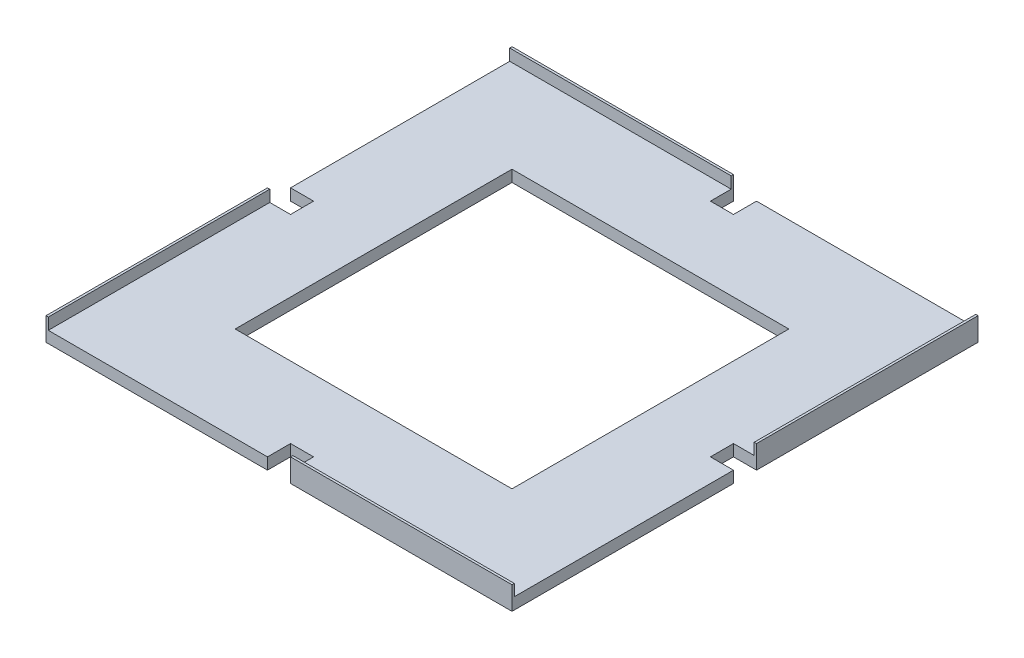
ISO-10303-21;
HEADER;
FILE_DESCRIPTION(('STEP AP214'),'2;1');
FILE_NAME('part.step','',(''),(''),'','','');
FILE_SCHEMA(('AUTOMOTIVE_DESIGN { 1 0 10303 214 1 1 1 1 }'));
ENDSEC;
DATA;
#1=APPLICATION_CONTEXT('core data for automotive mechanical design processes');
#2=APPLICATION_PROTOCOL_DEFINITION('international standard','automotive_design',2000,#1);
#3=PRODUCT_CONTEXT('',#1,'mechanical');
#4=PRODUCT('Part','Part','',(#3));
#5=PRODUCT_RELATED_PRODUCT_CATEGORY('part','',(#4));
#6=PRODUCT_DEFINITION_FORMATION('','',#4);
#7=PRODUCT_DEFINITION_CONTEXT('part definition',#1,'design');
#8=PRODUCT_DEFINITION('design','',#6,#7);
#9=PRODUCT_DEFINITION_SHAPE('','',#8);
#10=(LENGTH_UNIT() NAMED_UNIT(*) SI_UNIT(.MILLI.,.METRE.));
#11=(NAMED_UNIT(*) PLANE_ANGLE_UNIT() SI_UNIT($,.RADIAN.));
#12=(NAMED_UNIT(*) SI_UNIT($,.STERADIAN.) SOLID_ANGLE_UNIT());
#13=UNCERTAINTY_MEASURE_WITH_UNIT(LENGTH_MEASURE(1.E-05),#10,'distance_accuracy_value','');
#14=(GEOMETRIC_REPRESENTATION_CONTEXT(3) GLOBAL_UNCERTAINTY_ASSIGNED_CONTEXT((#13)) GLOBAL_UNIT_ASSIGNED_CONTEXT((#10,
#11,#12)) REPRESENTATION_CONTEXT('',''));
#15=CARTESIAN_POINT('',(0.,0.,0.));
#16=DIRECTION('',(0.,0.,1.));
#17=DIRECTION('',(1.,0.,0.));
#18=AXIS2_PLACEMENT_3D('',#15,#16,#17);
#19=CARTESIAN_POINT('',(0.,5.,0.));
#20=DIRECTION('',(0.,-1.,0.));
#21=DIRECTION('',(0.,0.,-1.));
#22=AXIS2_PLACEMENT_3D('',#19,#20,#21);
#23=PLANE('',#22);
#24=DIRECTION('',(0.,0.,-1.));
#25=VECTOR('',#24,1.);
#26=CARTESIAN_POINT('',(60.,5.,60.));
#27=LINE('',#26,#25);
#28=CARTESIAN_POINT('',(60.,5.,60.));
#29=VERTEX_POINT('',#28);
#30=CARTESIAN_POINT('',(60.,5.,-60.));
#31=VERTEX_POINT('',#30);
#32=EDGE_CURVE('E332',#29,#31,#27,.T.);
#33=ORIENTED_EDGE('',*,*,#32,.F.);
#34=DIRECTION('',(1.,0.,0.));
#35=VECTOR('',#34,1.);
#36=CARTESIAN_POINT('',(-60.,5.,60.));
#37=LINE('',#36,#35);
#38=CARTESIAN_POINT('',(-60.,5.,60.));
#39=VERTEX_POINT('',#38);
#40=EDGE_CURVE('E340',#39,#29,#37,.T.);
#41=ORIENTED_EDGE('',*,*,#40,.F.);
#42=DIRECTION('',(0.,0.,1.));
#43=VECTOR('',#42,1.);
#44=CARTESIAN_POINT('',(-60.,5.,60.));
#45=LINE('',#44,#43);
#46=CARTESIAN_POINT('',(-60.,5.,-60.));
#47=VERTEX_POINT('',#46);
#48=EDGE_CURVE('E337',#47,#39,#45,.T.);
#49=ORIENTED_EDGE('',*,*,#48,.F.);
#50=DIRECTION('',(-1.,0.,0.));
#51=VECTOR('',#50,1.);
#52=CARTESIAN_POINT('',(-60.,5.,-60.));
#53=LINE('',#52,#51);
#54=EDGE_CURVE('E334',#31,#47,#53,.T.);
#55=ORIENTED_EDGE('',*,*,#54,.F.);
#56=EDGE_LOOP('',(#33,#41,#49,#55));
#57=FACE_BOUND('',#56,.T.);
#58=DIRECTION('',(0.,0.,1.));
#59=VECTOR('',#58,1.);
#60=CARTESIAN_POINT('',(100.,5.,-4.99999999999894));
#61=LINE('',#60,#59);
#62=CARTESIAN_POINT('',(100.000000000001,5.,-100.999999999999));
#63=VERTEX_POINT('',#62);
#64=CARTESIAN_POINT('',(100.,5.,-5.));
#65=VERTEX_POINT('',#64);
#66=EDGE_CURVE('E256',#63,#65,#61,.T.);
#67=ORIENTED_EDGE('',*,*,#66,.F.);
#68=DIRECTION('',(-1.,0.,0.));
#69=VECTOR('',#68,1.);
#70=CARTESIAN_POINT('',(101.,5.,-101.));
#71=LINE('',#70,#69);
#72=CARTESIAN_POINT('',(5.00000000000002,5.,-101.));
#73=VERTEX_POINT('',#72);
#74=EDGE_CURVE('E245',#63,#73,#71,.T.);
#75=ORIENTED_EDGE('',*,*,#74,.T.);
#76=DIRECTION('',(0.,0.,1.));
#77=VECTOR('',#76,1.);
#78=CARTESIAN_POINT('',(5.00000000000002,5.,-101.));
#79=LINE('',#78,#77);
#80=CARTESIAN_POINT('',(5.00000000000001,5.,-91.));
#81=VERTEX_POINT('',#80);
#82=EDGE_CURVE('E254',#73,#81,#79,.T.);
#83=ORIENTED_EDGE('',*,*,#82,.T.);
#84=DIRECTION('',(-1.,0.,0.));
#85=VECTOR('',#84,1.);
#86=CARTESIAN_POINT('',(-5.,5.,-91.));
#87=LINE('',#86,#85);
#88=CARTESIAN_POINT('',(-5.,5.,-91.));
#89=VERTEX_POINT('',#88);
#90=EDGE_CURVE('E388',#81,#89,#87,.T.);
#91=ORIENTED_EDGE('',*,*,#90,.T.);
#92=DIRECTION('',(0.,0.,-1.));
#93=VECTOR('',#92,1.);
#94=CARTESIAN_POINT('',(-4.99999999999999,5.,-101.));
#95=LINE('',#94,#93);
#96=CARTESIAN_POINT('',(-4.99999999999999,5.,-100.));
#97=VERTEX_POINT('',#96);
#98=EDGE_CURVE('E390',#89,#97,#95,.T.);
#99=ORIENTED_EDGE('',*,*,#98,.T.);
#100=DIRECTION('',(1.,0.,0.));
#101=VECTOR('',#100,1.);
#102=CARTESIAN_POINT('',(-4.99999999999929,5.,-100.));
#103=LINE('',#102,#101);
#104=CARTESIAN_POINT('',(-101.,5.,-100.));
#105=VERTEX_POINT('',#104);
#106=EDGE_CURVE('E58',#105,#97,#103,.T.);
#107=ORIENTED_EDGE('',*,*,#106,.F.);
#108=DIRECTION('',(0.,0.,1.));
#109=VECTOR('',#108,1.);
#110=CARTESIAN_POINT('',(-101.,5.,-5.));
#111=LINE('',#110,#109);
#112=CARTESIAN_POINT('',(-101.,5.,-5.));
#113=VERTEX_POINT('',#112);
#114=EDGE_CURVE('E363',#105,#113,#111,.T.);
#115=ORIENTED_EDGE('',*,*,#114,.T.);
#116=DIRECTION('',(1.,0.,0.));
#117=VECTOR('',#116,1.);
#118=CARTESIAN_POINT('',(-101.,5.,-5.));
#119=LINE('',#118,#117);
#120=CARTESIAN_POINT('',(-90.9999999999999,5.,-5.00000000000001));
#121=VERTEX_POINT('',#120);
#122=EDGE_CURVE('E365',#113,#121,#119,.T.);
#123=ORIENTED_EDGE('',*,*,#122,.T.);
#124=DIRECTION('',(0.,0.,1.));
#125=VECTOR('',#124,1.);
#126=CARTESIAN_POINT('',(-91.,5.,5.00000000000001));
#127=LINE('',#126,#125);
#128=CARTESIAN_POINT('',(-91.,5.,5.00000000000001));
#129=VERTEX_POINT('',#128);
#130=EDGE_CURVE('E368',#121,#129,#127,.T.);
#131=ORIENTED_EDGE('',*,*,#130,.T.);
#132=DIRECTION('',(-1.,0.,0.));
#133=VECTOR('',#132,1.);
#134=CARTESIAN_POINT('',(-101.,5.,5.));
#135=LINE('',#134,#133);
#136=CARTESIAN_POINT('',(-100.,5.,5.));
#137=VERTEX_POINT('',#136);
#138=EDGE_CURVE('E370',#129,#137,#135,.T.);
#139=ORIENTED_EDGE('',*,*,#138,.T.);
#140=DIRECTION('',(0.,0.,-1.));
#141=VECTOR('',#140,1.);
#142=CARTESIAN_POINT('',(-100.,5.,4.99999999999964));
#143=LINE('',#142,#141);
#144=CARTESIAN_POINT('',(-100.,5.,101.));
#145=VERTEX_POINT('',#144);
#146=EDGE_CURVE('E300',#145,#137,#143,.T.);
#147=ORIENTED_EDGE('',*,*,#146,.F.);
#148=DIRECTION('',(1.,0.,0.));
#149=VECTOR('',#148,1.);
#150=CARTESIAN_POINT('',(-5.00000000000001,5.,101.));
#151=LINE('',#150,#149);
#152=CARTESIAN_POINT('',(-5.00000000000001,5.,101.));
#153=VERTEX_POINT('',#152);
#154=EDGE_CURVE('E372',#145,#153,#151,.T.);
#155=ORIENTED_EDGE('',*,*,#154,.T.);
#156=DIRECTION('',(0.,0.,-1.));
#157=VECTOR('',#156,1.);
#158=CARTESIAN_POINT('',(-5.00000000000001,5.,101.));
#159=LINE('',#158,#157);
#160=CARTESIAN_POINT('',(-4.99999999999998,5.,91.));
#161=VERTEX_POINT('',#160);
#162=EDGE_CURVE('E374',#153,#161,#159,.T.);
#163=ORIENTED_EDGE('',*,*,#162,.T.);
#164=DIRECTION('',(1.,0.,0.));
#165=VECTOR('',#164,1.);
#166=CARTESIAN_POINT('',(5.00000000000003,5.,91.));
#167=LINE('',#166,#165);
#168=CARTESIAN_POINT('',(5.00000000000003,5.,91.));
#169=VERTEX_POINT('',#168);
#170=EDGE_CURVE('E376',#161,#169,#167,.T.);
#171=ORIENTED_EDGE('',*,*,#170,.T.);
#172=DIRECTION('',(0.,0.,1.));
#173=VECTOR('',#172,1.);
#174=CARTESIAN_POINT('',(4.99999999999999,5.,101.));
#175=LINE('',#174,#173);
#176=CARTESIAN_POINT('',(4.99999999999999,5.,100.));
#177=VERTEX_POINT('',#176);
#178=EDGE_CURVE('E378',#169,#177,#175,.T.);
#179=ORIENTED_EDGE('',*,*,#178,.T.);
#180=DIRECTION('',(-1.,0.,0.));
#181=VECTOR('',#180,1.);
#182=CARTESIAN_POINT('',(4.99999999999999,5.,100.));
#183=LINE('',#182,#181);
#184=CARTESIAN_POINT('',(101.,5.,100.));
#185=VERTEX_POINT('',#184);
#186=EDGE_CURVE('E303',#185,#177,#183,.T.);
#187=ORIENTED_EDGE('',*,*,#186,.F.);
#188=DIRECTION('',(0.,0.,-1.));
#189=VECTOR('',#188,1.);
#190=CARTESIAN_POINT('',(101.,5.,101.));
#191=LINE('',#190,#189);
#192=CARTESIAN_POINT('',(101.,5.,5.));
#193=VERTEX_POINT('',#192);
#194=EDGE_CURVE('E380',#185,#193,#191,.T.);
#195=ORIENTED_EDGE('',*,*,#194,.T.);
#196=DIRECTION('',(-1.,0.,0.));
#197=VECTOR('',#196,1.);
#198=CARTESIAN_POINT('',(101.,5.,5.));
#199=LINE('',#198,#197);
#200=CARTESIAN_POINT('',(91.,5.,5.00000000000001));
#201=VERTEX_POINT('',#200);
#202=EDGE_CURVE('E382',#193,#201,#199,.T.);
#203=ORIENTED_EDGE('',*,*,#202,.T.);
#204=DIRECTION('',(0.,0.,-1.));
#205=VECTOR('',#204,1.);
#206=CARTESIAN_POINT('',(91.,5.,-4.99999999999999));
#207=LINE('',#206,#205);
#208=CARTESIAN_POINT('',(91.,5.,-4.99999999999999));
#209=VERTEX_POINT('',#208);
#210=EDGE_CURVE('E384',#201,#209,#207,.T.);
#211=ORIENTED_EDGE('',*,*,#210,.T.);
#212=DIRECTION('',(1.,0.,0.));
#213=VECTOR('',#212,1.);
#214=CARTESIAN_POINT('',(101.,5.,-5.));
#215=LINE('',#214,#213);
#216=EDGE_CURVE('E51',#209,#65,#215,.T.);
#217=ORIENTED_EDGE('',*,*,#216,.T.);
#218=EDGE_LOOP('',(#67,#75,#83,#91,#99,#107,#115,#123,#131,#139,#147,#155,#163,#171,#179,#187,
#195,#203,#211,#217));
#219=FACE_BOUND('',#218,.T.);
#220=ADVANCED_FACE('F36',(#57,#219),#23,.F.);
#221=CARTESIAN_POINT('',(0.,0.,0.));
#222=DIRECTION('',(0.,-1.,0.));
#223=DIRECTION('',(0.,0.,-1.));
#224=AXIS2_PLACEMENT_3D('',#221,#222,#223);
#225=PLANE('',#224);
#226=DIRECTION('',(-1.,0.,0.));
#227=VECTOR('',#226,1.);
#228=CARTESIAN_POINT('',(-4.99999999999999,0.,-101.));
#229=LINE('',#228,#227);
#230=CARTESIAN_POINT('',(-4.99999999999999,0.,-101.));
#231=VERTEX_POINT('',#230);
#232=CARTESIAN_POINT('',(-101.,0.,-101.));
#233=VERTEX_POINT('',#232);
#234=EDGE_CURVE('E362',#231,#233,#229,.T.);
#235=ORIENTED_EDGE('',*,*,#234,.F.);
#236=DIRECTION('',(0.,0.,-1.));
#237=VECTOR('',#236,1.);
#238=CARTESIAN_POINT('',(-4.99999999999999,0.,-101.));
#239=LINE('',#238,#237);
#240=CARTESIAN_POINT('',(-5.,0.,-91.));
#241=VERTEX_POINT('',#240);
#242=EDGE_CURVE('E366',#241,#231,#239,.T.);
#243=ORIENTED_EDGE('',*,*,#242,.F.);
#244=DIRECTION('',(-1.,0.,0.));
#245=VECTOR('',#244,1.);
#246=CARTESIAN_POINT('',(-5.,0.,-91.));
#247=LINE('',#246,#245);
#248=CARTESIAN_POINT('',(5.00000000000001,0.,-91.));
#249=VERTEX_POINT('',#248);
#250=EDGE_CURVE('E429',#249,#241,#247,.T.);
#251=ORIENTED_EDGE('',*,*,#250,.F.);
#252=DIRECTION('',(0.,0.,1.));
#253=VECTOR('',#252,1.);
#254=CARTESIAN_POINT('',(5.00000000000002,0.,-101.));
#255=LINE('',#254,#253);
#256=CARTESIAN_POINT('',(5.00000000000002,0.,-101.));
#257=VERTEX_POINT('',#256);
#258=EDGE_CURVE('E427',#257,#249,#255,.T.);
#259=ORIENTED_EDGE('',*,*,#258,.F.);
#260=DIRECTION('',(-1.,0.,0.));
#261=VECTOR('',#260,1.);
#262=CARTESIAN_POINT('',(101.,0.,-101.));
#263=LINE('',#262,#261);
#264=CARTESIAN_POINT('',(101.,0.,-101.));
#265=VERTEX_POINT('',#264);
#266=EDGE_CURVE('E425',#265,#257,#263,.T.);
#267=ORIENTED_EDGE('',*,*,#266,.F.);
#268=DIRECTION('',(0.,0.,-1.));
#269=VECTOR('',#268,1.);
#270=CARTESIAN_POINT('',(101.,0.,-5.));
#271=LINE('',#270,#269);
#272=CARTESIAN_POINT('',(101.,0.,-5.));
#273=VERTEX_POINT('',#272);
#274=EDGE_CURVE('E423',#273,#265,#271,.T.);
#275=ORIENTED_EDGE('',*,*,#274,.F.);
#276=DIRECTION('',(1.,0.,0.));
#277=VECTOR('',#276,1.);
#278=CARTESIAN_POINT('',(101.,0.,-5.));
#279=LINE('',#278,#277);
#280=CARTESIAN_POINT('',(91.,0.,-4.99999999999999));
#281=VERTEX_POINT('',#280);
#282=EDGE_CURVE('E421',#281,#273,#279,.T.);
#283=ORIENTED_EDGE('',*,*,#282,.F.);
#284=DIRECTION('',(0.,0.,-1.));
#285=VECTOR('',#284,1.);
#286=CARTESIAN_POINT('',(91.,0.,-4.99999999999999));
#287=LINE('',#286,#285);
#288=CARTESIAN_POINT('',(91.,0.,5.00000000000001));
#289=VERTEX_POINT('',#288);
#290=EDGE_CURVE('E419',#289,#281,#287,.T.);
#291=ORIENTED_EDGE('',*,*,#290,.F.);
#292=DIRECTION('',(-1.,0.,0.));
#293=VECTOR('',#292,1.);
#294=CARTESIAN_POINT('',(101.,0.,5.));
#295=LINE('',#294,#293);
#296=CARTESIAN_POINT('',(101.,0.,5.));
#297=VERTEX_POINT('',#296);
#298=EDGE_CURVE('E417',#297,#289,#295,.T.);
#299=ORIENTED_EDGE('',*,*,#298,.F.);
#300=DIRECTION('',(0.,0.,-1.));
#301=VECTOR('',#300,1.);
#302=CARTESIAN_POINT('',(101.,0.,101.));
#303=LINE('',#302,#301);
#304=CARTESIAN_POINT('',(101.,0.,101.));
#305=VERTEX_POINT('',#304);
#306=EDGE_CURVE('E415',#305,#297,#303,.T.);
#307=ORIENTED_EDGE('',*,*,#306,.F.);
#308=DIRECTION('',(1.,0.,0.));
#309=VECTOR('',#308,1.);
#310=CARTESIAN_POINT('',(101.,0.,101.));
#311=LINE('',#310,#309);
#312=CARTESIAN_POINT('',(4.99999999999999,0.,101.));
#313=VERTEX_POINT('',#312);
#314=EDGE_CURVE('E413',#313,#305,#311,.T.);
#315=ORIENTED_EDGE('',*,*,#314,.F.);
#316=DIRECTION('',(0.,0.,1.));
#317=VECTOR('',#316,1.);
#318=CARTESIAN_POINT('',(4.99999999999999,0.,101.));
#319=LINE('',#318,#317);
#320=CARTESIAN_POINT('',(5.00000000000003,0.,91.));
#321=VERTEX_POINT('',#320);
#322=EDGE_CURVE('E411',#321,#313,#319,.T.);
#323=ORIENTED_EDGE('',*,*,#322,.F.);
#324=DIRECTION('',(1.,0.,0.));
#325=VECTOR('',#324,1.);
#326=CARTESIAN_POINT('',(5.00000000000003,0.,91.));
#327=LINE('',#326,#325);
#328=CARTESIAN_POINT('',(-4.99999999999998,0.,91.));
#329=VERTEX_POINT('',#328);
#330=EDGE_CURVE('E409',#329,#321,#327,.T.);
#331=ORIENTED_EDGE('',*,*,#330,.F.);
#332=DIRECTION('',(0.,0.,-1.));
#333=VECTOR('',#332,1.);
#334=CARTESIAN_POINT('',(-5.00000000000001,0.,101.));
#335=LINE('',#334,#333);
#336=CARTESIAN_POINT('',(-5.00000000000001,0.,101.));
#337=VERTEX_POINT('',#336);
#338=EDGE_CURVE('E407',#337,#329,#335,.T.);
#339=ORIENTED_EDGE('',*,*,#338,.F.);
#340=DIRECTION('',(1.,0.,0.));
#341=VECTOR('',#340,1.);
#342=CARTESIAN_POINT('',(-5.00000000000001,0.,101.));
#343=LINE('',#342,#341);
#344=CARTESIAN_POINT('',(-101.,0.,101.));
#345=VERTEX_POINT('',#344);
#346=EDGE_CURVE('E405',#345,#337,#343,.T.);
#347=ORIENTED_EDGE('',*,*,#346,.F.);
#348=DIRECTION('',(0.,0.,1.));
#349=VECTOR('',#348,1.);
#350=CARTESIAN_POINT('',(-101.,0.,101.));
#351=LINE('',#350,#349);
#352=CARTESIAN_POINT('',(-101.,0.,5.));
#353=VERTEX_POINT('',#352);
#354=EDGE_CURVE('E403',#353,#345,#351,.T.);
#355=ORIENTED_EDGE('',*,*,#354,.F.);
#356=DIRECTION('',(-1.,0.,0.));
#357=VECTOR('',#356,1.);
#358=CARTESIAN_POINT('',(-101.,0.,5.));
#359=LINE('',#358,#357);
#360=CARTESIAN_POINT('',(-91.,0.,5.00000000000001));
#361=VERTEX_POINT('',#360);
#362=EDGE_CURVE('E401',#361,#353,#359,.T.);
#363=ORIENTED_EDGE('',*,*,#362,.F.);
#364=DIRECTION('',(0.,0.,1.));
#365=VECTOR('',#364,1.);
#366=CARTESIAN_POINT('',(-91.,0.,5.00000000000001));
#367=LINE('',#366,#365);
#368=CARTESIAN_POINT('',(-90.9999999999999,0.,-5.00000000000001));
#369=VERTEX_POINT('',#368);
#370=EDGE_CURVE('E399',#369,#361,#367,.T.);
#371=ORIENTED_EDGE('',*,*,#370,.F.);
#372=DIRECTION('',(1.,0.,0.));
#373=VECTOR('',#372,1.);
#374=CARTESIAN_POINT('',(-101.,0.,-5.));
#375=LINE('',#374,#373);
#376=CARTESIAN_POINT('',(-101.,0.,-5.));
#377=VERTEX_POINT('',#376);
#378=EDGE_CURVE('E397',#377,#369,#375,.T.);
#379=ORIENTED_EDGE('',*,*,#378,.F.);
#380=DIRECTION('',(0.,0.,1.));
#381=VECTOR('',#380,1.);
#382=CARTESIAN_POINT('',(-101.,0.,-5.));
#383=LINE('',#382,#381);
#384=EDGE_CURVE('E395',#233,#377,#383,.T.);
#385=ORIENTED_EDGE('',*,*,#384,.F.);
#386=EDGE_LOOP('',(#235,#243,#251,#259,#267,#275,#283,#291,#299,#307,#315,#323,#331,#339,#347,
#355,#363,#371,#379,#385));
#387=FACE_BOUND('',#386,.T.);
#388=DIRECTION('',(1.,0.,0.));
#389=VECTOR('',#388,1.);
#390=CARTESIAN_POINT('',(-60.,0.,60.));
#391=LINE('',#390,#389);
#392=CARTESIAN_POINT('',(-60.,0.,60.));
#393=VERTEX_POINT('',#392);
#394=CARTESIAN_POINT('',(60.,0.,60.));
#395=VERTEX_POINT('',#394);
#396=EDGE_CURVE('E335',#393,#395,#391,.T.);
#397=ORIENTED_EDGE('',*,*,#396,.T.);
#398=DIRECTION('',(0.,0.,-1.));
#399=VECTOR('',#398,1.);
#400=CARTESIAN_POINT('',(60.,0.,60.));
#401=LINE('',#400,#399);
#402=CARTESIAN_POINT('',(60.,0.,-60.));
#403=VERTEX_POINT('',#402);
#404=EDGE_CURVE('E331',#395,#403,#401,.T.);
#405=ORIENTED_EDGE('',*,*,#404,.T.);
#406=DIRECTION('',(-1.,0.,0.));
#407=VECTOR('',#406,1.);
#408=CARTESIAN_POINT('',(-60.,0.,-60.));
#409=LINE('',#408,#407);
#410=CARTESIAN_POINT('',(-60.,0.,-60.));
#411=VERTEX_POINT('',#410);
#412=EDGE_CURVE('E345',#403,#411,#409,.T.);
#413=ORIENTED_EDGE('',*,*,#412,.T.);
#414=DIRECTION('',(0.,0.,1.));
#415=VECTOR('',#414,1.);
#416=CARTESIAN_POINT('',(-60.,0.,60.));
#417=LINE('',#416,#415);
#418=EDGE_CURVE('E348',#411,#393,#417,.T.);
#419=ORIENTED_EDGE('',*,*,#418,.T.);
#420=EDGE_LOOP('',(#397,#405,#413,#419));
#421=FACE_BOUND('',#420,.T.);
#422=ADVANCED_FACE('F493',(#387,#421),#225,.T.);
#423=CARTESIAN_POINT('',(-4.99999999999999,5.,-101.));
#424=DIRECTION('',(0.,0.,1.));
#425=DIRECTION('',(1.,0.,0.));
#426=AXIS2_PLACEMENT_3D('',#423,#424,#425);
#427=PLANE('',#426);
#428=ORIENTED_EDGE('',*,*,#234,.T.);
#429=DIRECTION('',(0.,-1.,0.));
#430=VECTOR('',#429,1.);
#431=CARTESIAN_POINT('',(-101.,5.,-101.));
#432=LINE('',#431,#430);
#433=CARTESIAN_POINT('',(-100.999999999999,10.,-101.000000000001));
#434=VERTEX_POINT('',#433);
#435=EDGE_CURVE('E11',#434,#233,#432,.T.);
#436=ORIENTED_EDGE('',*,*,#435,.F.);
#437=DIRECTION('',(-1.,0.,0.));
#438=VECTOR('',#437,1.);
#439=CARTESIAN_POINT('',(-4.99999999999929,10.,-101.));
#440=LINE('',#439,#438);
#441=CARTESIAN_POINT('',(-4.99999999999929,10.,-101.));
#442=VERTEX_POINT('',#441);
#443=EDGE_CURVE('E285',#442,#434,#440,.T.);
#444=ORIENTED_EDGE('',*,*,#443,.F.);
#445=DIRECTION('',(0.,-1.,0.));
#446=VECTOR('',#445,1.);
#447=CARTESIAN_POINT('',(-4.99999999999999,5.,-101.));
#448=LINE('',#447,#446);
#449=EDGE_CURVE('E392',#442,#231,#448,.T.);
#450=ORIENTED_EDGE('',*,*,#449,.T.);
#451=EDGE_LOOP('',(#428,#436,#444,#450));
#452=FACE_BOUND('',#451,.T.);
#453=ADVANCED_FACE('F38',(#452),#427,.F.);
#454=CARTESIAN_POINT('',(-101.,5.,-5.));
#455=DIRECTION('',(1.,0.,0.));
#456=DIRECTION('',(0.,0.,-1.));
#457=AXIS2_PLACEMENT_3D('',#454,#455,#456);
#458=PLANE('',#457);
#459=ORIENTED_EDGE('',*,*,#384,.T.);
#460=DIRECTION('',(0.,-1.,0.));
#461=VECTOR('',#460,1.);
#462=CARTESIAN_POINT('',(-101.,5.,-5.));
#463=LINE('',#462,#461);
#464=EDGE_CURVE('E44',#113,#377,#463,.T.);
#465=ORIENTED_EDGE('',*,*,#464,.F.);
#466=ORIENTED_EDGE('',*,*,#114,.F.);
#467=DIRECTION('',(0.,-1.,0.));
#468=VECTOR('',#467,1.);
#469=CARTESIAN_POINT('',(-100.999999999999,10.,-100.000000000001));
#470=LINE('',#469,#468);
#471=CARTESIAN_POINT('',(-100.999999999999,10.,-100.000000000001));
#472=VERTEX_POINT('',#471);
#473=EDGE_CURVE('E260',#472,#105,#470,.T.);
#474=ORIENTED_EDGE('',*,*,#473,.F.);
#475=DIRECTION('',(0.,0.,1.));
#476=VECTOR('',#475,1.);
#477=CARTESIAN_POINT('',(-100.999999999999,10.,-101.000000000001));
#478=LINE('',#477,#476);
#479=EDGE_CURVE('E290',#434,#472,#478,.T.);
#480=ORIENTED_EDGE('',*,*,#479,.F.);
#481=ORIENTED_EDGE('',*,*,#435,.T.);
#482=EDGE_LOOP('',(#459,#465,#466,#474,#480,#481));
#483=FACE_BOUND('',#482,.T.);
#484=ADVANCED_FACE('F585',(#483),#458,.F.);
#485=CARTESIAN_POINT('',(-101.,5.,-5.));
#486=DIRECTION('',(0.,0.,-1.));
#487=DIRECTION('',(-1.,0.,0.));
#488=AXIS2_PLACEMENT_3D('',#485,#486,#487);
#489=PLANE('',#488);
#490=ORIENTED_EDGE('',*,*,#378,.T.);
#491=DIRECTION('',(0.,-1.,0.));
#492=VECTOR('',#491,1.);
#493=CARTESIAN_POINT('',(-90.9999999999999,5.,-5.00000000000001));
#494=LINE('',#493,#492);
#495=EDGE_CURVE('E480',#121,#369,#494,.T.);
#496=ORIENTED_EDGE('',*,*,#495,.F.);
#497=ORIENTED_EDGE('',*,*,#122,.F.);
#498=ORIENTED_EDGE('',*,*,#464,.T.);
#499=EDGE_LOOP('',(#490,#496,#497,#498));
#500=FACE_BOUND('',#499,.T.);
#501=ADVANCED_FACE('F487',(#500),#489,.F.);
#502=CARTESIAN_POINT('',(-91.,5.,5.00000000000001));
#503=DIRECTION('',(1.,0.,0.));
#504=DIRECTION('',(0.,0.,-1.));
#505=AXIS2_PLACEMENT_3D('',#502,#503,#504);
#506=PLANE('',#505);
#507=ORIENTED_EDGE('',*,*,#370,.T.);
#508=DIRECTION('',(0.,-1.,0.));
#509=VECTOR('',#508,1.);
#510=CARTESIAN_POINT('',(-91.,5.,5.00000000000001));
#511=LINE('',#510,#509);
#512=EDGE_CURVE('E477',#129,#361,#511,.T.);
#513=ORIENTED_EDGE('',*,*,#512,.F.);
#514=ORIENTED_EDGE('',*,*,#130,.F.);
#515=ORIENTED_EDGE('',*,*,#495,.T.);
#516=EDGE_LOOP('',(#507,#513,#514,#515));
#517=FACE_BOUND('',#516,.T.);
#518=ADVANCED_FACE('F499',(#517),#506,.F.);
#519=CARTESIAN_POINT('',(-101.,5.,5.));
#520=DIRECTION('',(0.,0.,1.));
#521=DIRECTION('',(1.,0.,0.));
#522=AXIS2_PLACEMENT_3D('',#519,#520,#521);
#523=PLANE('',#522);
#524=ORIENTED_EDGE('',*,*,#362,.T.);
#525=DIRECTION('',(0.,-1.,0.));
#526=VECTOR('',#525,1.);
#527=CARTESIAN_POINT('',(-101.,5.,5.));
#528=LINE('',#527,#526);
#529=CARTESIAN_POINT('',(-101.,10.,4.99999999999964));
#530=VERTEX_POINT('',#529);
#531=EDGE_CURVE('E474',#530,#353,#528,.T.);
#532=ORIENTED_EDGE('',*,*,#531,.F.);
#533=DIRECTION('',(-1.,0.,0.));
#534=VECTOR('',#533,1.);
#535=CARTESIAN_POINT('',(-101.,10.,4.99999999999964));
#536=LINE('',#535,#534);
#537=CARTESIAN_POINT('',(-100.,10.,4.99999999999964));
#538=VERTEX_POINT('',#537);
#539=EDGE_CURVE('E299',#538,#530,#536,.T.);
#540=ORIENTED_EDGE('',*,*,#539,.F.);
#541=DIRECTION('',(0.,-1.,0.));
#542=VECTOR('',#541,1.);
#543=CARTESIAN_POINT('',(-100.,10.,4.99999999999964));
#544=LINE('',#543,#542);
#545=EDGE_CURVE('E296',#538,#137,#544,.T.);
#546=ORIENTED_EDGE('',*,*,#545,.T.);
#547=ORIENTED_EDGE('',*,*,#138,.F.);
#548=ORIENTED_EDGE('',*,*,#512,.T.);
#549=EDGE_LOOP('',(#524,#532,#540,#546,#547,#548));
#550=FACE_BOUND('',#549,.T.);
#551=ADVANCED_FACE('F503',(#550),#523,.F.);
#552=CARTESIAN_POINT('',(-101.,5.,101.));
#553=DIRECTION('',(1.,0.,0.));
#554=DIRECTION('',(0.,0.,-1.));
#555=AXIS2_PLACEMENT_3D('',#552,#553,#554);
#556=PLANE('',#555);
#557=ORIENTED_EDGE('',*,*,#354,.T.);
#558=DIRECTION('',(0.,-1.,0.));
#559=VECTOR('',#558,1.);
#560=CARTESIAN_POINT('',(-101.,5.,101.));
#561=LINE('',#560,#559);
#562=CARTESIAN_POINT('',(-101.,10.,101.));
#563=VERTEX_POINT('',#562);
#564=EDGE_CURVE('E471',#563,#345,#561,.T.);
#565=ORIENTED_EDGE('',*,*,#564,.F.);
#566=DIRECTION('',(0.,0.,1.));
#567=VECTOR('',#566,1.);
#568=CARTESIAN_POINT('',(-101.,10.,4.99999999999964));
#569=LINE('',#568,#567);
#570=EDGE_CURVE('E304',#530,#563,#569,.T.);
#571=ORIENTED_EDGE('',*,*,#570,.F.);
#572=ORIENTED_EDGE('',*,*,#531,.T.);
#573=EDGE_LOOP('',(#557,#565,#571,#572));
#574=FACE_BOUND('',#573,.T.);
#575=ADVANCED_FACE('F634',(#574),#556,.F.);
#576=CARTESIAN_POINT('',(-5.00000000000001,5.,101.));
#577=DIRECTION('',(0.,0.,-1.));
#578=DIRECTION('',(-1.,0.,0.));
#579=AXIS2_PLACEMENT_3D('',#576,#577,#578);
#580=PLANE('',#579);
#581=ORIENTED_EDGE('',*,*,#346,.T.);
#582=DIRECTION('',(0.,-1.,0.));
#583=VECTOR('',#582,1.);
#584=CARTESIAN_POINT('',(-5.00000000000001,5.,101.));
#585=LINE('',#584,#583);
#586=EDGE_CURVE('E468',#153,#337,#585,.T.);
#587=ORIENTED_EDGE('',*,*,#586,.F.);
#588=ORIENTED_EDGE('',*,*,#154,.F.);
#589=DIRECTION('',(0.,-1.,0.));
#590=VECTOR('',#589,1.);
#591=CARTESIAN_POINT('',(-100.,10.,101.));
#592=LINE('',#591,#590);
#593=CARTESIAN_POINT('',(-100.,10.,101.));
#594=VERTEX_POINT('',#593);
#595=EDGE_CURVE('E284',#594,#145,#592,.T.);
#596=ORIENTED_EDGE('',*,*,#595,.F.);
#597=DIRECTION('',(1.,0.,0.));
#598=VECTOR('',#597,1.);
#599=CARTESIAN_POINT('',(-101.,10.,101.));
#600=LINE('',#599,#598);
#601=EDGE_CURVE('E309',#563,#594,#600,.T.);
#602=ORIENTED_EDGE('',*,*,#601,.F.);
#603=ORIENTED_EDGE('',*,*,#564,.T.);
#604=EDGE_LOOP('',(#581,#587,#588,#596,#602,#603));
#605=FACE_BOUND('',#604,.T.);
#606=ADVANCED_FACE('F513',(#605),#580,.F.);
#607=CARTESIAN_POINT('',(-5.00000000000001,5.,101.));
#608=DIRECTION('',(-1.,0.,0.));
#609=DIRECTION('',(0.,0.,1.));
#610=AXIS2_PLACEMENT_3D('',#607,#608,#609);
#611=PLANE('',#610);
#612=ORIENTED_EDGE('',*,*,#338,.T.);
#613=DIRECTION('',(0.,-1.,0.));
#614=VECTOR('',#613,1.);
#615=CARTESIAN_POINT('',(-4.99999999999998,5.,91.));
#616=LINE('',#615,#614);
#617=EDGE_CURVE('E465',#161,#329,#616,.T.);
#618=ORIENTED_EDGE('',*,*,#617,.F.);
#619=ORIENTED_EDGE('',*,*,#162,.F.);
#620=ORIENTED_EDGE('',*,*,#586,.T.);
#621=EDGE_LOOP('',(#612,#618,#619,#620));
#622=FACE_BOUND('',#621,.T.);
#623=ADVANCED_FACE('F520',(#622),#611,.F.);
#624=CARTESIAN_POINT('',(5.00000000000003,5.,91.));
#625=DIRECTION('',(0.,0.,-1.));
#626=DIRECTION('',(-1.,0.,0.));
#627=AXIS2_PLACEMENT_3D('',#624,#625,#626);
#628=PLANE('',#627);
#629=ORIENTED_EDGE('',*,*,#330,.T.);
#630=DIRECTION('',(0.,-1.,0.));
#631=VECTOR('',#630,1.);
#632=CARTESIAN_POINT('',(5.00000000000003,5.,91.));
#633=LINE('',#632,#631);
#634=EDGE_CURVE('E462',#169,#321,#633,.T.);
#635=ORIENTED_EDGE('',*,*,#634,.F.);
#636=ORIENTED_EDGE('',*,*,#170,.F.);
#637=ORIENTED_EDGE('',*,*,#617,.T.);
#638=EDGE_LOOP('',(#629,#635,#636,#637));
#639=FACE_BOUND('',#638,.T.);
#640=ADVANCED_FACE('F524',(#639),#628,.F.);
#641=CARTESIAN_POINT('',(4.99999999999999,5.,101.));
#642=DIRECTION('',(1.,0.,0.));
#643=DIRECTION('',(0.,0.,-1.));
#644=AXIS2_PLACEMENT_3D('',#641,#642,#643);
#645=PLANE('',#644);
#646=ORIENTED_EDGE('',*,*,#322,.T.);
#647=DIRECTION('',(0.,-1.,0.));
#648=VECTOR('',#647,1.);
#649=CARTESIAN_POINT('',(4.99999999999999,5.,101.));
#650=LINE('',#649,#648);
#651=CARTESIAN_POINT('',(4.99999999999999,10.,101.));
#652=VERTEX_POINT('',#651);
#653=EDGE_CURVE('E459',#652,#313,#650,.T.);
#654=ORIENTED_EDGE('',*,*,#653,.F.);
#655=DIRECTION('',(0.,0.,1.));
#656=VECTOR('',#655,1.);
#657=CARTESIAN_POINT('',(4.99999999999999,10.,101.));
#658=LINE('',#657,#656);
#659=CARTESIAN_POINT('',(4.99999999999999,10.,100.));
#660=VERTEX_POINT('',#659);
#661=EDGE_CURVE('E313',#660,#652,#658,.T.);
#662=ORIENTED_EDGE('',*,*,#661,.F.);
#663=DIRECTION('',(0.,-1.,0.));
#664=VECTOR('',#663,1.);
#665=CARTESIAN_POINT('',(4.99999999999999,10.,100.));
#666=LINE('',#665,#664);
#667=EDGE_CURVE('E323',#660,#177,#666,.T.);
#668=ORIENTED_EDGE('',*,*,#667,.T.);
#669=ORIENTED_EDGE('',*,*,#178,.F.);
#670=ORIENTED_EDGE('',*,*,#634,.T.);
#671=EDGE_LOOP('',(#646,#654,#662,#668,#669,#670));
#672=FACE_BOUND('',#671,.T.);
#673=ADVANCED_FACE('F528',(#672),#645,.F.);
#674=CARTESIAN_POINT('',(101.,5.,101.));
#675=DIRECTION('',(0.,0.,-1.));
#676=DIRECTION('',(-1.,0.,0.));
#677=AXIS2_PLACEMENT_3D('',#674,#675,#676);
#678=PLANE('',#677);
#679=ORIENTED_EDGE('',*,*,#314,.T.);
#680=DIRECTION('',(0.,-1.,0.));
#681=VECTOR('',#680,1.);
#682=CARTESIAN_POINT('',(101.,5.,101.));
#683=LINE('',#682,#681);
#684=CARTESIAN_POINT('',(101.,10.,101.));
#685=VERTEX_POINT('',#684);
#686=EDGE_CURVE('E456',#685,#305,#683,.T.);
#687=ORIENTED_EDGE('',*,*,#686,.F.);
#688=DIRECTION('',(1.,0.,0.));
#689=VECTOR('',#688,1.);
#690=CARTESIAN_POINT('',(4.99999999999999,10.,101.));
#691=LINE('',#690,#689);
#692=EDGE_CURVE('E316',#652,#685,#691,.T.);
#693=ORIENTED_EDGE('',*,*,#692,.F.);
#694=ORIENTED_EDGE('',*,*,#653,.T.);
#695=EDGE_LOOP('',(#679,#687,#693,#694));
#696=FACE_BOUND('',#695,.T.);
#697=ADVANCED_FACE('F622',(#696),#678,.F.);
#698=CARTESIAN_POINT('',(101.,5.,101.));
#699=DIRECTION('',(-1.,0.,0.));
#700=DIRECTION('',(0.,0.,1.));
#701=AXIS2_PLACEMENT_3D('',#698,#699,#700);
#702=PLANE('',#701);
#703=ORIENTED_EDGE('',*,*,#306,.T.);
#704=DIRECTION('',(0.,-1.,0.));
#705=VECTOR('',#704,1.);
#706=CARTESIAN_POINT('',(101.,5.,5.));
#707=LINE('',#706,#705);
#708=EDGE_CURVE('E453',#193,#297,#707,.T.);
#709=ORIENTED_EDGE('',*,*,#708,.F.);
#710=ORIENTED_EDGE('',*,*,#194,.F.);
#711=DIRECTION('',(0.,-1.,0.));
#712=VECTOR('',#711,1.);
#713=CARTESIAN_POINT('',(101.,10.,100.));
#714=LINE('',#713,#712);
#715=CARTESIAN_POINT('',(101.,10.,100.));
#716=VERTEX_POINT('',#715);
#717=EDGE_CURVE('E328',#716,#185,#714,.T.);
#718=ORIENTED_EDGE('',*,*,#717,.F.);
#719=DIRECTION('',(0.,0.,-1.));
#720=VECTOR('',#719,1.);
#721=CARTESIAN_POINT('',(101.,10.,101.));
#722=LINE('',#721,#720);
#723=EDGE_CURVE('E319',#685,#716,#722,.T.);
#724=ORIENTED_EDGE('',*,*,#723,.F.);
#725=ORIENTED_EDGE('',*,*,#686,.T.);
#726=EDGE_LOOP('',(#703,#709,#710,#718,#724,#725));
#727=FACE_BOUND('',#726,.T.);
#728=ADVANCED_FACE('F538',(#727),#702,.F.);
#729=CARTESIAN_POINT('',(101.,5.,5.));
#730=DIRECTION('',(0.,0.,1.));
#731=DIRECTION('',(1.,0.,0.));
#732=AXIS2_PLACEMENT_3D('',#729,#730,#731);
#733=PLANE('',#732);
#734=ORIENTED_EDGE('',*,*,#298,.T.);
#735=DIRECTION('',(0.,-1.,0.));
#736=VECTOR('',#735,1.);
#737=CARTESIAN_POINT('',(91.,5.,5.00000000000001));
#738=LINE('',#737,#736);
#739=EDGE_CURVE('E450',#201,#289,#738,.T.);
#740=ORIENTED_EDGE('',*,*,#739,.F.);
#741=ORIENTED_EDGE('',*,*,#202,.F.);
#742=ORIENTED_EDGE('',*,*,#708,.T.);
#743=EDGE_LOOP('',(#734,#740,#741,#742));
#744=FACE_BOUND('',#743,.T.);
#745=ADVANCED_FACE('F545',(#744),#733,.F.);
#746=CARTESIAN_POINT('',(91.,5.,-4.99999999999999));
#747=DIRECTION('',(-1.,0.,0.));
#748=DIRECTION('',(0.,0.,1.));
#749=AXIS2_PLACEMENT_3D('',#746,#747,#748);
#750=PLANE('',#749);
#751=ORIENTED_EDGE('',*,*,#290,.T.);
#752=DIRECTION('',(0.,-1.,0.));
#753=VECTOR('',#752,1.);
#754=CARTESIAN_POINT('',(91.,5.,-4.99999999999999));
#755=LINE('',#754,#753);
#756=EDGE_CURVE('E447',#209,#281,#755,.T.);
#757=ORIENTED_EDGE('',*,*,#756,.F.);
#758=ORIENTED_EDGE('',*,*,#210,.F.);
#759=ORIENTED_EDGE('',*,*,#739,.T.);
#760=EDGE_LOOP('',(#751,#757,#758,#759));
#761=FACE_BOUND('',#760,.T.);
#762=ADVANCED_FACE('F549',(#761),#750,.F.);
#763=CARTESIAN_POINT('',(101.,5.,-5.));
#764=DIRECTION('',(0.,0.,-1.));
#765=DIRECTION('',(-1.,0.,0.));
#766=AXIS2_PLACEMENT_3D('',#763,#764,#765);
#767=PLANE('',#766);
#768=ORIENTED_EDGE('',*,*,#282,.T.);
#769=DIRECTION('',(0.,-1.,0.));
#770=VECTOR('',#769,1.);
#771=CARTESIAN_POINT('',(101.,5.,-5.));
#772=LINE('',#771,#770);
#773=CARTESIAN_POINT('',(101.,10.,-4.99999999999893));
#774=VERTEX_POINT('',#773);
#775=EDGE_CURVE('E444',#774,#273,#772,.T.);
#776=ORIENTED_EDGE('',*,*,#775,.F.);
#777=DIRECTION('',(1.,0.,0.));
#778=VECTOR('',#777,1.);
#779=CARTESIAN_POINT('',(101.,10.,-4.99999999999893));
#780=LINE('',#779,#778);
#781=CARTESIAN_POINT('',(100.,10.,-4.99999999999894));
#782=VERTEX_POINT('',#781);
#783=EDGE_CURVE('E267',#782,#774,#780,.T.);
#784=ORIENTED_EDGE('',*,*,#783,.F.);
#785=DIRECTION('',(0.,-1.,0.));
#786=VECTOR('',#785,1.);
#787=CARTESIAN_POINT('',(100.,10.,-4.99999999999894));
#788=LINE('',#787,#786);
#789=EDGE_CURVE('E265',#782,#65,#788,.T.);
#790=ORIENTED_EDGE('',*,*,#789,.T.);
#791=ORIENTED_EDGE('',*,*,#216,.F.);
#792=ORIENTED_EDGE('',*,*,#756,.T.);
#793=EDGE_LOOP('',(#768,#776,#784,#790,#791,#792));
#794=FACE_BOUND('',#793,.T.);
#795=ADVANCED_FACE('F552',(#794),#767,.F.);
#796=CARTESIAN_POINT('',(101.,5.,-5.));
#797=DIRECTION('',(-1.,0.,0.));
#798=DIRECTION('',(0.,0.,1.));
#799=AXIS2_PLACEMENT_3D('',#796,#797,#798);
#800=PLANE('',#799);
#801=ORIENTED_EDGE('',*,*,#274,.T.);
#802=DIRECTION('',(0.,-1.,0.));
#803=VECTOR('',#802,1.);
#804=CARTESIAN_POINT('',(101.,5.,-101.));
#805=LINE('',#804,#803);
#806=CARTESIAN_POINT('',(101.000000000001,10.,-100.999999999999));
#807=VERTEX_POINT('',#806);
#808=EDGE_CURVE('E441',#807,#265,#805,.T.);
#809=ORIENTED_EDGE('',*,*,#808,.F.);
#810=DIRECTION('',(0.,0.,-1.));
#811=VECTOR('',#810,1.);
#812=CARTESIAN_POINT('',(101.,10.,-4.99999999999893));
#813=LINE('',#812,#811);
#814=EDGE_CURVE('E261',#774,#807,#813,.T.);
#815=ORIENTED_EDGE('',*,*,#814,.F.);
#816=ORIENTED_EDGE('',*,*,#775,.T.);
#817=EDGE_LOOP('',(#801,#809,#815,#816));
#818=FACE_BOUND('',#817,.T.);
#819=ADVANCED_FACE('F558',(#818),#800,.F.);
#820=CARTESIAN_POINT('',(101.,5.,-101.));
#821=DIRECTION('',(0.,0.,1.));
#822=DIRECTION('',(1.,0.,0.));
#823=AXIS2_PLACEMENT_3D('',#820,#821,#822);
#824=PLANE('',#823);
#825=ORIENTED_EDGE('',*,*,#266,.T.);
#826=DIRECTION('',(0.,-1.,0.));
#827=VECTOR('',#826,1.);
#828=CARTESIAN_POINT('',(5.00000000000002,5.,-101.));
#829=LINE('',#828,#827);
#830=EDGE_CURVE('E252',#73,#257,#829,.T.);
#831=ORIENTED_EDGE('',*,*,#830,.F.);
#832=ORIENTED_EDGE('',*,*,#74,.F.);
#833=DIRECTION('',(0.,-1.,0.));
#834=VECTOR('',#833,1.);
#835=CARTESIAN_POINT('',(100.000000000001,10.,-100.999999999999));
#836=LINE('',#835,#834);
#837=CARTESIAN_POINT('',(100.000000000001,10.,-100.999999999999));
#838=VERTEX_POINT('',#837);
#839=EDGE_CURVE('E249',#838,#63,#836,.T.);
#840=ORIENTED_EDGE('',*,*,#839,.F.);
#841=DIRECTION('',(-1.,0.,0.));
#842=VECTOR('',#841,1.);
#843=CARTESIAN_POINT('',(101.000000000001,10.,-100.999999999999));
#844=LINE('',#843,#842);
#845=EDGE_CURVE('E273',#807,#838,#844,.T.);
#846=ORIENTED_EDGE('',*,*,#845,.F.);
#847=ORIENTED_EDGE('',*,*,#808,.T.);
#848=EDGE_LOOP('',(#825,#831,#832,#840,#846,#847));
#849=FACE_BOUND('',#848,.T.);
#850=ADVANCED_FACE('F246',(#849),#824,.F.);
#851=CARTESIAN_POINT('',(5.00000000000002,5.,-101.));
#852=DIRECTION('',(1.,0.,0.));
#853=DIRECTION('',(0.,0.,-1.));
#854=AXIS2_PLACEMENT_3D('',#851,#852,#853);
#855=PLANE('',#854);
#856=ORIENTED_EDGE('',*,*,#258,.T.);
#857=DIRECTION('',(0.,-1.,0.));
#858=VECTOR('',#857,1.);
#859=CARTESIAN_POINT('',(5.00000000000001,5.,-91.));
#860=LINE('',#859,#858);
#861=EDGE_CURVE('E437',#81,#249,#860,.T.);
#862=ORIENTED_EDGE('',*,*,#861,.F.);
#863=ORIENTED_EDGE('',*,*,#82,.F.);
#864=ORIENTED_EDGE('',*,*,#830,.T.);
#865=EDGE_LOOP('',(#856,#862,#863,#864));
#866=FACE_BOUND('',#865,.T.);
#867=ADVANCED_FACE('F566',(#866),#855,.F.);
#868=CARTESIAN_POINT('',(-5.,5.,-91.));
#869=DIRECTION('',(0.,0.,1.));
#870=DIRECTION('',(1.,0.,0.));
#871=AXIS2_PLACEMENT_3D('',#868,#869,#870);
#872=PLANE('',#871);
#873=ORIENTED_EDGE('',*,*,#250,.T.);
#874=DIRECTION('',(0.,-1.,0.));
#875=VECTOR('',#874,1.);
#876=CARTESIAN_POINT('',(-5.,5.,-91.));
#877=LINE('',#876,#875);
#878=EDGE_CURVE('E434',#89,#241,#877,.T.);
#879=ORIENTED_EDGE('',*,*,#878,.F.);
#880=ORIENTED_EDGE('',*,*,#90,.F.);
#881=ORIENTED_EDGE('',*,*,#861,.T.);
#882=EDGE_LOOP('',(#873,#879,#880,#881));
#883=FACE_BOUND('',#882,.T.);
#884=ADVANCED_FACE('F569',(#883),#872,.F.);
#885=CARTESIAN_POINT('',(-4.99999999999999,5.,-101.));
#886=DIRECTION('',(-1.,0.,0.));
#887=DIRECTION('',(0.,0.,1.));
#888=AXIS2_PLACEMENT_3D('',#885,#886,#887);
#889=PLANE('',#888);
#890=ORIENTED_EDGE('',*,*,#242,.T.);
#891=ORIENTED_EDGE('',*,*,#449,.F.);
#892=DIRECTION('',(0.,0.,-1.));
#893=VECTOR('',#892,1.);
#894=CARTESIAN_POINT('',(-4.99999999999929,10.,-101.));
#895=LINE('',#894,#893);
#896=CARTESIAN_POINT('',(-4.99999999999929,10.,-100.));
#897=VERTEX_POINT('',#896);
#898=EDGE_CURVE('E282',#897,#442,#895,.T.);
#899=ORIENTED_EDGE('',*,*,#898,.F.);
#900=DIRECTION('',(0.,-1.,0.));
#901=VECTOR('',#900,1.);
#902=CARTESIAN_POINT('',(-4.99999999999929,10.,-100.));
#903=LINE('',#902,#901);
#904=EDGE_CURVE('E279',#897,#97,#903,.T.);
#905=ORIENTED_EDGE('',*,*,#904,.T.);
#906=ORIENTED_EDGE('',*,*,#98,.F.);
#907=ORIENTED_EDGE('',*,*,#878,.T.);
#908=EDGE_LOOP('',(#890,#891,#899,#905,#906,#907));
#909=FACE_BOUND('',#908,.T.);
#910=ADVANCED_FACE('F579',(#909),#889,.F.);
#911=CARTESIAN_POINT('',(60.,5.,60.));
#912=DIRECTION('',(-1.,0.,0.));
#913=DIRECTION('',(0.,0.,1.));
#914=AXIS2_PLACEMENT_3D('',#911,#912,#913);
#915=PLANE('',#914);
#916=ORIENTED_EDGE('',*,*,#404,.F.);
#917=DIRECTION('',(0.,-1.,0.));
#918=VECTOR('',#917,1.);
#919=CARTESIAN_POINT('',(60.,5.,60.));
#920=LINE('',#919,#918);
#921=EDGE_CURVE('E342',#29,#395,#920,.T.);
#922=ORIENTED_EDGE('',*,*,#921,.F.);
#923=ORIENTED_EDGE('',*,*,#32,.T.);
#924=DIRECTION('',(0.,-1.,0.));
#925=VECTOR('',#924,1.);
#926=CARTESIAN_POINT('',(60.,5.,-60.));
#927=LINE('',#926,#925);
#928=EDGE_CURVE('E359',#31,#403,#927,.T.);
#929=ORIENTED_EDGE('',*,*,#928,.T.);
#930=EDGE_LOOP('',(#916,#922,#923,#929));
#931=FACE_BOUND('',#930,.T.);
#932=ADVANCED_FACE('F601',(#931),#915,.T.);
#933=CARTESIAN_POINT('',(-60.,5.,-60.));
#934=DIRECTION('',(0.,0.,1.));
#935=DIRECTION('',(1.,0.,0.));
#936=AXIS2_PLACEMENT_3D('',#933,#934,#935);
#937=PLANE('',#936);
#938=ORIENTED_EDGE('',*,*,#412,.F.);
#939=ORIENTED_EDGE('',*,*,#928,.F.);
#940=ORIENTED_EDGE('',*,*,#54,.T.);
#941=DIRECTION('',(0.,-1.,0.));
#942=VECTOR('',#941,1.);
#943=CARTESIAN_POINT('',(-60.,5.,-60.));
#944=LINE('',#943,#942);
#945=EDGE_CURVE('E357',#47,#411,#944,.T.);
#946=ORIENTED_EDGE('',*,*,#945,.T.);
#947=EDGE_LOOP('',(#938,#939,#940,#946));
#948=FACE_BOUND('',#947,.T.);
#949=ADVANCED_FACE('F716',(#948),#937,.T.);
#950=CARTESIAN_POINT('',(-60.,5.,60.));
#951=DIRECTION('',(1.,0.,0.));
#952=DIRECTION('',(0.,0.,-1.));
#953=AXIS2_PLACEMENT_3D('',#950,#951,#952);
#954=PLANE('',#953);
#955=ORIENTED_EDGE('',*,*,#418,.F.);
#956=ORIENTED_EDGE('',*,*,#945,.F.);
#957=ORIENTED_EDGE('',*,*,#48,.T.);
#958=DIRECTION('',(0.,-1.,0.));
#959=VECTOR('',#958,1.);
#960=CARTESIAN_POINT('',(-60.,5.,60.));
#961=LINE('',#960,#959);
#962=EDGE_CURVE('E355',#39,#393,#961,.T.);
#963=ORIENTED_EDGE('',*,*,#962,.T.);
#964=EDGE_LOOP('',(#955,#956,#957,#963));
#965=FACE_BOUND('',#964,.T.);
#966=ADVANCED_FACE('F723',(#965),#954,.T.);
#967=CARTESIAN_POINT('',(-60.,5.,60.));
#968=DIRECTION('',(0.,0.,-1.));
#969=DIRECTION('',(-1.,0.,0.));
#970=AXIS2_PLACEMENT_3D('',#967,#968,#969);
#971=PLANE('',#970);
#972=ORIENTED_EDGE('',*,*,#396,.F.);
#973=ORIENTED_EDGE('',*,*,#962,.F.);
#974=ORIENTED_EDGE('',*,*,#40,.T.);
#975=ORIENTED_EDGE('',*,*,#921,.T.);
#976=EDGE_LOOP('',(#972,#973,#974,#975));
#977=FACE_BOUND('',#976,.T.);
#978=ADVANCED_FACE('F730',(#977),#971,.T.);
#979=CARTESIAN_POINT('',(4.99999999999999,10.,100.));
#980=DIRECTION('',(0.,0.,1.));
#981=DIRECTION('',(1.,0.,0.));
#982=AXIS2_PLACEMENT_3D('',#979,#980,#981);
#983=PLANE('',#982);
#984=ORIENTED_EDGE('',*,*,#186,.T.);
#985=ORIENTED_EDGE('',*,*,#667,.F.);
#986=DIRECTION('',(-1.,0.,0.));
#987=VECTOR('',#986,1.);
#988=CARTESIAN_POINT('',(4.99999999999999,10.,100.));
#989=LINE('',#988,#987);
#990=EDGE_CURVE('E321',#716,#660,#989,.T.);
#991=ORIENTED_EDGE('',*,*,#990,.F.);
#992=ORIENTED_EDGE('',*,*,#717,.T.);
#993=EDGE_LOOP('',(#984,#985,#991,#992));
#994=FACE_BOUND('',#993,.T.);
#995=ADVANCED_FACE('F533',(#994),#983,.F.);
#996=CARTESIAN_POINT('',(0.,10.,0.));
#997=DIRECTION('',(0.,-1.,0.));
#998=DIRECTION('',(0.,0.,-1.));
#999=AXIS2_PLACEMENT_3D('',#996,#997,#998);
#1000=PLANE('',#999);
#1001=ORIENTED_EDGE('',*,*,#661,.T.);
#1002=ORIENTED_EDGE('',*,*,#692,.T.);
#1003=ORIENTED_EDGE('',*,*,#723,.T.);
#1004=ORIENTED_EDGE('',*,*,#990,.T.);
#1005=EDGE_LOOP('',(#1001,#1002,#1003,#1004));
#1006=FACE_BOUND('',#1005,.T.);
#1007=ADVANCED_FACE('F744',(#1006),#1000,.F.);
#1008=CARTESIAN_POINT('',(-100.,10.,4.99999999999964));
#1009=DIRECTION('',(-1.,0.,0.));
#1010=DIRECTION('',(0.,0.,1.));
#1011=AXIS2_PLACEMENT_3D('',#1008,#1009,#1010);
#1012=PLANE('',#1011);
#1013=ORIENTED_EDGE('',*,*,#146,.T.);
#1014=ORIENTED_EDGE('',*,*,#545,.F.);
#1015=DIRECTION('',(0.,0.,-1.));
#1016=VECTOR('',#1015,1.);
#1017=CARTESIAN_POINT('',(-100.,10.,4.99999999999964));
#1018=LINE('',#1017,#1016);
#1019=EDGE_CURVE('E307',#594,#538,#1018,.T.);
#1020=ORIENTED_EDGE('',*,*,#1019,.F.);
#1021=ORIENTED_EDGE('',*,*,#595,.T.);
#1022=EDGE_LOOP('',(#1013,#1014,#1020,#1021));
#1023=FACE_BOUND('',#1022,.T.);
#1024=ADVANCED_FACE('F508',(#1023),#1012,.F.);
#1025=CARTESIAN_POINT('',(0.,10.,0.));
#1026=DIRECTION('',(0.,1.,0.));
#1027=DIRECTION('',(0.,0.,1.));
#1028=AXIS2_PLACEMENT_3D('',#1025,#1026,#1027);
#1029=PLANE('',#1028);
#1030=ORIENTED_EDGE('',*,*,#570,.T.);
#1031=ORIENTED_EDGE('',*,*,#601,.T.);
#1032=ORIENTED_EDGE('',*,*,#1019,.T.);
#1033=ORIENTED_EDGE('',*,*,#539,.T.);
#1034=EDGE_LOOP('',(#1030,#1031,#1032,#1033));
#1035=FACE_BOUND('',#1034,.T.);
#1036=ADVANCED_FACE('F758',(#1035),#1029,.T.);
#1037=CARTESIAN_POINT('',(-4.99999999999929,10.,-100.));
#1038=DIRECTION('',(0.,0.,-1.));
#1039=DIRECTION('',(-1.,0.,0.));
#1040=AXIS2_PLACEMENT_3D('',#1037,#1038,#1039);
#1041=PLANE('',#1040);
#1042=ORIENTED_EDGE('',*,*,#106,.T.);
#1043=ORIENTED_EDGE('',*,*,#904,.F.);
#1044=DIRECTION('',(1.,0.,0.));
#1045=VECTOR('',#1044,1.);
#1046=CARTESIAN_POINT('',(-4.99999999999929,10.,-100.));
#1047=LINE('',#1046,#1045);
#1048=EDGE_CURVE('E288',#472,#897,#1047,.T.);
#1049=ORIENTED_EDGE('',*,*,#1048,.F.);
#1050=ORIENTED_EDGE('',*,*,#473,.T.);
#1051=EDGE_LOOP('',(#1042,#1043,#1049,#1050));
#1052=FACE_BOUND('',#1051,.T.);
#1053=ADVANCED_FACE('F575',(#1052),#1041,.F.);
#1054=CARTESIAN_POINT('',(0.,10.,0.));
#1055=DIRECTION('',(0.,1.,0.));
#1056=DIRECTION('',(0.,0.,1.));
#1057=AXIS2_PLACEMENT_3D('',#1054,#1055,#1056);
#1058=PLANE('',#1057);
#1059=ORIENTED_EDGE('',*,*,#443,.T.);
#1060=ORIENTED_EDGE('',*,*,#479,.T.);
#1061=ORIENTED_EDGE('',*,*,#1048,.T.);
#1062=ORIENTED_EDGE('',*,*,#898,.T.);
#1063=EDGE_LOOP('',(#1059,#1060,#1061,#1062));
#1064=FACE_BOUND('',#1063,.T.);
#1065=ADVANCED_FACE('F582',(#1064),#1058,.T.);
#1066=CARTESIAN_POINT('',(100.,10.,-4.99999999999894));
#1067=DIRECTION('',(1.,0.,0.));
#1068=DIRECTION('',(0.,0.,-1.));
#1069=AXIS2_PLACEMENT_3D('',#1066,#1067,#1068);
#1070=PLANE('',#1069);
#1071=ORIENTED_EDGE('',*,*,#66,.T.);
#1072=ORIENTED_EDGE('',*,*,#789,.F.);
#1073=DIRECTION('',(0.,0.,1.));
#1074=VECTOR('',#1073,1.);
#1075=CARTESIAN_POINT('',(100.,10.,-4.99999999999894));
#1076=LINE('',#1075,#1074);
#1077=EDGE_CURVE('E264',#838,#782,#1076,.T.);
#1078=ORIENTED_EDGE('',*,*,#1077,.F.);
#1079=ORIENTED_EDGE('',*,*,#839,.T.);
#1080=EDGE_LOOP('',(#1071,#1072,#1078,#1079));
#1081=FACE_BOUND('',#1080,.T.);
#1082=ADVANCED_FACE('F263',(#1081),#1070,.F.);
#1083=CARTESIAN_POINT('',(0.,10.,0.));
#1084=DIRECTION('',(0.,1.,0.));
#1085=DIRECTION('',(0.,0.,1.));
#1086=AXIS2_PLACEMENT_3D('',#1083,#1084,#1085);
#1087=PLANE('',#1086);
#1088=ORIENTED_EDGE('',*,*,#814,.T.);
#1089=ORIENTED_EDGE('',*,*,#845,.T.);
#1090=ORIENTED_EDGE('',*,*,#1077,.T.);
#1091=ORIENTED_EDGE('',*,*,#783,.T.);
#1092=EDGE_LOOP('',(#1088,#1089,#1090,#1091));
#1093=FACE_BOUND('',#1092,.T.);
#1094=ADVANCED_FACE('F556',(#1093),#1087,.T.);
#1095=CLOSED_SHELL('',(#220,#422,#453,#484,#501,#518,#551,#575,#606,#623,#640,#673,#697,#728,
#745,#762,#795,#819,#850,#867,#884,#910,#932,#949,#966,#978,#995,#1007,#1024,#1036,#1053,#1065,
#1082,#1094));
#1096=MANIFOLD_SOLID_BREP('B2',#1095);
#1097=ADVANCED_BREP_SHAPE_REPRESENTATION('',(#18,#1096),#14);
#1098=SHAPE_DEFINITION_REPRESENTATION(#9,#1097);
ENDSEC;
END-ISO-10303-21;
